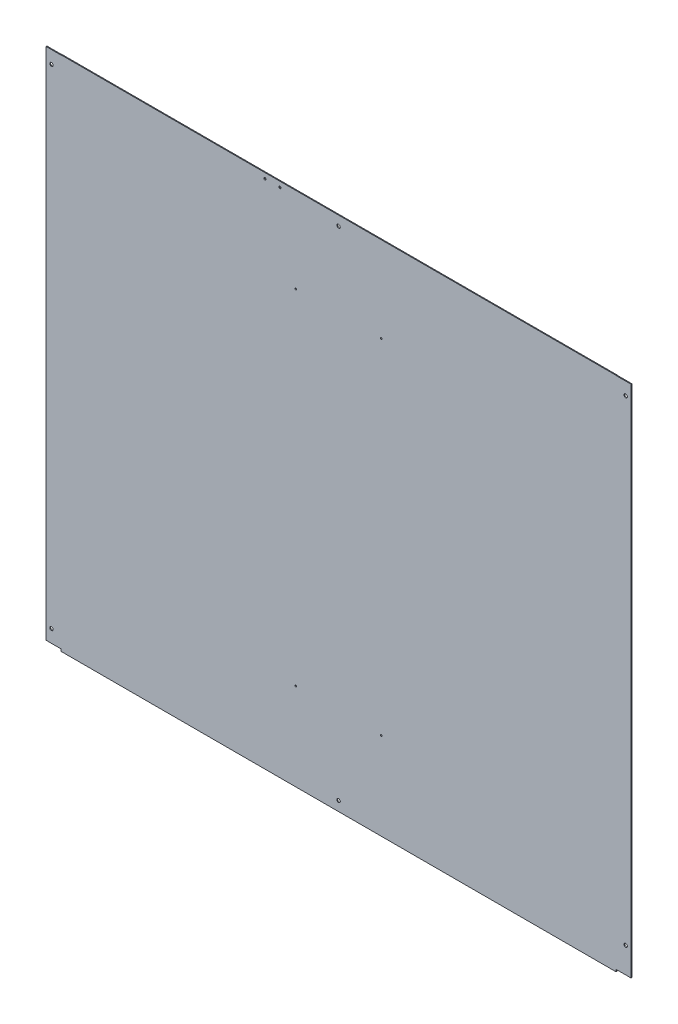
ISO-10303-21;
HEADER;
FILE_DESCRIPTION(('STEP AP214'),'2;1');
FILE_NAME('part.step','',(''),(''),'','','');
FILE_SCHEMA(('AUTOMOTIVE_DESIGN { 1 0 10303 214 1 1 1 1 }'));
ENDSEC;
DATA;
#1=APPLICATION_CONTEXT('core data for automotive mechanical design processes');
#2=APPLICATION_PROTOCOL_DEFINITION('international standard','automotive_design',2000,#1);
#3=PRODUCT_CONTEXT('',#1,'mechanical');
#4=PRODUCT('Part','Part','',(#3));
#5=PRODUCT_RELATED_PRODUCT_CATEGORY('part','',(#4));
#6=PRODUCT_DEFINITION_FORMATION('','',#4);
#7=PRODUCT_DEFINITION_CONTEXT('part definition',#1,'design');
#8=PRODUCT_DEFINITION('design','',#6,#7);
#9=PRODUCT_DEFINITION_SHAPE('','',#8);
#10=(LENGTH_UNIT() NAMED_UNIT(*) SI_UNIT(.MILLI.,.METRE.));
#11=(NAMED_UNIT(*) PLANE_ANGLE_UNIT() SI_UNIT($,.RADIAN.));
#12=(NAMED_UNIT(*) SI_UNIT($,.STERADIAN.) SOLID_ANGLE_UNIT());
#13=UNCERTAINTY_MEASURE_WITH_UNIT(LENGTH_MEASURE(1.E-05),#10,'distance_accuracy_value','');
#14=(GEOMETRIC_REPRESENTATION_CONTEXT(3) GLOBAL_UNCERTAINTY_ASSIGNED_CONTEXT((#13)) GLOBAL_UNIT_ASSIGNED_CONTEXT((#10,
#11,#12)) REPRESENTATION_CONTEXT('',''));
#15=CARTESIAN_POINT('',(0.,0.,0.));
#16=DIRECTION('',(0.,0.,1.));
#17=DIRECTION('',(1.,0.,0.));
#18=AXIS2_PLACEMENT_3D('',#15,#16,#17);
#19=CARTESIAN_POINT('',(1335.,0.,-2.));
#20=DIRECTION('',(1.,0.,0.));
#21=DIRECTION('',(0.,1.,0.));
#22=AXIS2_PLACEMENT_3D('',#19,#20,#21);
#23=PLANE('',#22);
#24=DIRECTION('',(0.,1.,0.));
#25=VECTOR('',#24,1.);
#26=CARTESIAN_POINT('',(1335.,0.,0.));
#27=LINE('',#26,#25);
#28=CARTESIAN_POINT('',(1335.,0.,0.));
#29=VERTEX_POINT('',#28);
#30=CARTESIAN_POINT('',(1335.,5.,0.));
#31=VERTEX_POINT('',#30);
#32=EDGE_CURVE('E155',#29,#31,#27,.T.);
#33=ORIENTED_EDGE('',*,*,#32,.F.);
#34=DIRECTION('',(0.,0.,1.));
#35=VECTOR('',#34,1.);
#36=CARTESIAN_POINT('',(1335.,0.,-2.));
#37=LINE('',#36,#35);
#38=CARTESIAN_POINT('',(1335.,0.,-2.));
#39=VERTEX_POINT('',#38);
#40=EDGE_CURVE('E11',#39,#29,#37,.T.);
#41=ORIENTED_EDGE('',*,*,#40,.F.);
#42=DIRECTION('',(0.,1.,0.));
#43=VECTOR('',#42,1.);
#44=CARTESIAN_POINT('',(1335.,0.,-2.));
#45=LINE('',#44,#43);
#46=CARTESIAN_POINT('',(1335.,5.,-2.));
#47=VERTEX_POINT('',#46);
#48=EDGE_CURVE('E188',#39,#47,#45,.T.);
#49=ORIENTED_EDGE('',*,*,#48,.T.);
#50=DIRECTION('',(0.,0.,1.));
#51=VECTOR('',#50,1.);
#52=CARTESIAN_POINT('',(1335.,5.,-2.));
#53=LINE('',#52,#51);
#54=EDGE_CURVE('E37',#47,#31,#53,.T.);
#55=ORIENTED_EDGE('',*,*,#54,.T.);
#56=EDGE_LOOP('',(#33,#41,#49,#55));
#57=FACE_BOUND('',#56,.T.);
#58=ADVANCED_FACE('F34',(#57),#23,.T.);
#59=CARTESIAN_POINT('',(35.,0.,-2.));
#60=DIRECTION('',(0.,-1.,0.));
#61=DIRECTION('',(0.,0.,-1.));
#62=AXIS2_PLACEMENT_3D('',#59,#60,#61);
#63=PLANE('',#62);
#64=DIRECTION('',(1.,0.,0.));
#65=VECTOR('',#64,1.);
#66=CARTESIAN_POINT('',(35.,0.,0.));
#67=LINE('',#66,#65);
#68=CARTESIAN_POINT('',(35.,0.,0.));
#69=VERTEX_POINT('',#68);
#70=EDGE_CURVE('E186',#69,#29,#67,.T.);
#71=ORIENTED_EDGE('',*,*,#70,.F.);
#72=DIRECTION('',(0.,0.,1.));
#73=VECTOR('',#72,1.);
#74=CARTESIAN_POINT('',(35.,0.,-2.));
#75=LINE('',#74,#73);
#76=CARTESIAN_POINT('',(35.,0.,-2.));
#77=VERTEX_POINT('',#76);
#78=EDGE_CURVE('E43',#77,#69,#75,.T.);
#79=ORIENTED_EDGE('',*,*,#78,.F.);
#80=DIRECTION('',(1.,0.,0.));
#81=VECTOR('',#80,1.);
#82=CARTESIAN_POINT('',(35.,0.,-2.));
#83=LINE('',#82,#81);
#84=EDGE_CURVE('E145',#77,#39,#83,.T.);
#85=ORIENTED_EDGE('',*,*,#84,.T.);
#86=ORIENTED_EDGE('',*,*,#40,.T.);
#87=EDGE_LOOP('',(#71,#79,#85,#86));
#88=FACE_BOUND('',#87,.T.);
#89=ADVANCED_FACE('F208',(#88),#63,.T.);
#90=CARTESIAN_POINT('',(35.,0.,-2.));
#91=DIRECTION('',(-1.,0.,0.));
#92=DIRECTION('',(0.,0.,1.));
#93=AXIS2_PLACEMENT_3D('',#90,#91,#92);
#94=PLANE('',#93);
#95=DIRECTION('',(0.,-1.,0.));
#96=VECTOR('',#95,1.);
#97=CARTESIAN_POINT('',(35.,0.,0.));
#98=LINE('',#97,#96);
#99=CARTESIAN_POINT('',(35.,5.,0.));
#100=VERTEX_POINT('',#99);
#101=EDGE_CURVE('E132',#100,#69,#98,.T.);
#102=ORIENTED_EDGE('',*,*,#101,.F.);
#103=DIRECTION('',(0.,0.,1.));
#104=VECTOR('',#103,1.);
#105=CARTESIAN_POINT('',(35.,5.,-2.));
#106=LINE('',#105,#104);
#107=CARTESIAN_POINT('',(35.,5.,-2.));
#108=VERTEX_POINT('',#107);
#109=EDGE_CURVE('E127',#108,#100,#106,.T.);
#110=ORIENTED_EDGE('',*,*,#109,.F.);
#111=DIRECTION('',(0.,-1.,0.));
#112=VECTOR('',#111,1.);
#113=CARTESIAN_POINT('',(35.,0.,-2.));
#114=LINE('',#113,#112);
#115=EDGE_CURVE('E130',#108,#77,#114,.T.);
#116=ORIENTED_EDGE('',*,*,#115,.T.);
#117=ORIENTED_EDGE('',*,*,#78,.T.);
#118=EDGE_LOOP('',(#102,#110,#116,#117));
#119=FACE_BOUND('',#118,.T.);
#120=ADVANCED_FACE('F129',(#119),#94,.T.);
#121=CARTESIAN_POINT('',(35.,5.,-2.));
#122=DIRECTION('',(0.,-1.,0.));
#123=DIRECTION('',(1.,0.,0.));
#124=AXIS2_PLACEMENT_3D('',#121,#122,#123);
#125=PLANE('',#124);
#126=DIRECTION('',(1.,0.,0.));
#127=VECTOR('',#126,1.);
#128=CARTESIAN_POINT('',(35.,5.,0.));
#129=LINE('',#128,#127);
#130=CARTESIAN_POINT('',(1.52655665885959E-13,5.,0.));
#131=VERTEX_POINT('',#130);
#132=EDGE_CURVE('E183',#131,#100,#129,.T.);
#133=ORIENTED_EDGE('',*,*,#132,.F.);
#134=DIRECTION('',(0.,0.,1.));
#135=VECTOR('',#134,1.);
#136=CARTESIAN_POINT('',(1.52655665885959E-13,5.,-2.));
#137=LINE('',#136,#135);
#138=CARTESIAN_POINT('',(1.52655665885959E-13,5.,-2.));
#139=VERTEX_POINT('',#138);
#140=EDGE_CURVE('E137',#139,#131,#137,.T.);
#141=ORIENTED_EDGE('',*,*,#140,.F.);
#142=DIRECTION('',(1.,0.,0.));
#143=VECTOR('',#142,1.);
#144=CARTESIAN_POINT('',(35.,5.,-2.));
#145=LINE('',#144,#143);
#146=EDGE_CURVE('E143',#139,#108,#145,.T.);
#147=ORIENTED_EDGE('',*,*,#146,.T.);
#148=ORIENTED_EDGE('',*,*,#109,.T.);
#149=EDGE_LOOP('',(#133,#141,#147,#148));
#150=FACE_BOUND('',#149,.T.);
#151=ADVANCED_FACE('F147',(#150),#125,.T.);
#152=CARTESIAN_POINT('',(0.,1209.5,-2.));
#153=DIRECTION('',(-1.,0.,0.));
#154=DIRECTION('',(0.,-1.,0.));
#155=AXIS2_PLACEMENT_3D('',#152,#153,#154);
#156=PLANE('',#155);
#157=DIRECTION('',(0.,-1.,0.));
#158=VECTOR('',#157,1.);
#159=CARTESIAN_POINT('',(0.,1209.5,0.));
#160=LINE('',#159,#158);
#161=CARTESIAN_POINT('',(0.,1209.5,0.));
#162=VERTEX_POINT('',#161);
#163=EDGE_CURVE('E180',#162,#131,#160,.T.);
#164=ORIENTED_EDGE('',*,*,#163,.F.);
#165=DIRECTION('',(0.,0.,1.));
#166=VECTOR('',#165,1.);
#167=CARTESIAN_POINT('',(0.,1209.5,-2.));
#168=LINE('',#167,#166);
#169=CARTESIAN_POINT('',(0.,1209.5,-2.));
#170=VERTEX_POINT('',#169);
#171=EDGE_CURVE('E192',#170,#162,#168,.T.);
#172=ORIENTED_EDGE('',*,*,#171,.F.);
#173=DIRECTION('',(0.,-1.,0.));
#174=VECTOR('',#173,1.);
#175=CARTESIAN_POINT('',(0.,1209.5,-2.));
#176=LINE('',#175,#174);
#177=EDGE_CURVE('E148',#170,#139,#176,.T.);
#178=ORIENTED_EDGE('',*,*,#177,.T.);
#179=ORIENTED_EDGE('',*,*,#140,.T.);
#180=EDGE_LOOP('',(#164,#172,#178,#179));
#181=FACE_BOUND('',#180,.T.);
#182=ADVANCED_FACE('F221',(#181),#156,.T.);
#183=CARTESIAN_POINT('',(35.,1209.5,-2.));
#184=DIRECTION('',(0.,1.,0.));
#185=DIRECTION('',(-1.,0.,0.));
#186=AXIS2_PLACEMENT_3D('',#183,#184,#185);
#187=PLANE('',#186);
#188=DIRECTION('',(-1.,0.,0.));
#189=VECTOR('',#188,1.);
#190=CARTESIAN_POINT('',(35.,1209.5,0.));
#191=LINE('',#190,#189);
#192=CARTESIAN_POINT('',(35.,1209.5,0.));
#193=VERTEX_POINT('',#192);
#194=EDGE_CURVE('E177',#193,#162,#191,.T.);
#195=ORIENTED_EDGE('',*,*,#194,.F.);
#196=DIRECTION('',(0.,0.,1.));
#197=VECTOR('',#196,1.);
#198=CARTESIAN_POINT('',(35.,1209.5,-2.));
#199=LINE('',#198,#197);
#200=CARTESIAN_POINT('',(35.,1209.5,-2.));
#201=VERTEX_POINT('',#200);
#202=EDGE_CURVE('E194',#201,#193,#199,.T.);
#203=ORIENTED_EDGE('',*,*,#202,.F.);
#204=DIRECTION('',(-1.,0.,0.));
#205=VECTOR('',#204,1.);
#206=CARTESIAN_POINT('',(35.,1209.5,-2.));
#207=LINE('',#206,#205);
#208=EDGE_CURVE('E150',#201,#170,#207,.T.);
#209=ORIENTED_EDGE('',*,*,#208,.T.);
#210=ORIENTED_EDGE('',*,*,#171,.T.);
#211=EDGE_LOOP('',(#195,#203,#209,#210));
#212=FACE_BOUND('',#211,.T.);
#213=ADVANCED_FACE('F224',(#212),#187,.T.);
#214=CARTESIAN_POINT('',(35.,1210.,-2.));
#215=DIRECTION('',(-1.,0.,0.));
#216=DIRECTION('',(0.,0.,1.));
#217=AXIS2_PLACEMENT_3D('',#214,#215,#216);
#218=PLANE('',#217);
#219=DIRECTION('',(0.,-1.,0.));
#220=VECTOR('',#219,1.);
#221=CARTESIAN_POINT('',(35.,1210.,0.));
#222=LINE('',#221,#220);
#223=CARTESIAN_POINT('',(35.,1210.,0.));
#224=VERTEX_POINT('',#223);
#225=EDGE_CURVE('E174',#224,#193,#222,.T.);
#226=ORIENTED_EDGE('',*,*,#225,.F.);
#227=DIRECTION('',(0.,0.,1.));
#228=VECTOR('',#227,1.);
#229=CARTESIAN_POINT('',(35.,1210.,-2.));
#230=LINE('',#229,#228);
#231=CARTESIAN_POINT('',(35.,1210.,-2.));
#232=VERTEX_POINT('',#231);
#233=EDGE_CURVE('E196',#232,#224,#230,.T.);
#234=ORIENTED_EDGE('',*,*,#233,.F.);
#235=DIRECTION('',(0.,-1.,0.));
#236=VECTOR('',#235,1.);
#237=CARTESIAN_POINT('',(35.,1210.,-2.));
#238=LINE('',#237,#236);
#239=EDGE_CURVE('E398',#232,#201,#238,.T.);
#240=ORIENTED_EDGE('',*,*,#239,.T.);
#241=ORIENTED_EDGE('',*,*,#202,.T.);
#242=EDGE_LOOP('',(#226,#234,#240,#241));
#243=FACE_BOUND('',#242,.T.);
#244=ADVANCED_FACE('F228',(#243),#218,.T.);
#245=CARTESIAN_POINT('',(1335.,1210.,-2.));
#246=DIRECTION('',(0.,1.,0.));
#247=DIRECTION('',(0.,0.,1.));
#248=AXIS2_PLACEMENT_3D('',#245,#246,#247);
#249=PLANE('',#248);
#250=DIRECTION('',(-1.,0.,0.));
#251=VECTOR('',#250,1.);
#252=CARTESIAN_POINT('',(1335.,1210.,0.));
#253=LINE('',#252,#251);
#254=CARTESIAN_POINT('',(1335.,1210.,0.));
#255=VERTEX_POINT('',#254);
#256=EDGE_CURVE('E171',#255,#224,#253,.T.);
#257=ORIENTED_EDGE('',*,*,#256,.F.);
#258=DIRECTION('',(0.,0.,1.));
#259=VECTOR('',#258,1.);
#260=CARTESIAN_POINT('',(1335.,1210.,-2.));
#261=LINE('',#260,#259);
#262=CARTESIAN_POINT('',(1335.,1210.,-2.));
#263=VERTEX_POINT('',#262);
#264=EDGE_CURVE('E198',#263,#255,#261,.T.);
#265=ORIENTED_EDGE('',*,*,#264,.F.);
#266=DIRECTION('',(-1.,0.,0.));
#267=VECTOR('',#266,1.);
#268=CARTESIAN_POINT('',(1335.,1210.,-2.));
#269=LINE('',#268,#267);
#270=EDGE_CURVE('E395',#263,#232,#269,.T.);
#271=ORIENTED_EDGE('',*,*,#270,.T.);
#272=ORIENTED_EDGE('',*,*,#233,.T.);
#273=EDGE_LOOP('',(#257,#265,#271,#272));
#274=FACE_BOUND('',#273,.T.);
#275=ADVANCED_FACE('F232',(#274),#249,.T.);
#276=CARTESIAN_POINT('',(1335.,1210.,-2.));
#277=DIRECTION('',(1.,0.,0.));
#278=DIRECTION('',(0.,0.,-1.));
#279=AXIS2_PLACEMENT_3D('',#276,#277,#278);
#280=PLANE('',#279);
#281=DIRECTION('',(0.,1.,0.));
#282=VECTOR('',#281,1.);
#283=CARTESIAN_POINT('',(1335.,1210.,0.));
#284=LINE('',#283,#282);
#285=CARTESIAN_POINT('',(1335.,1209.5,0.));
#286=VERTEX_POINT('',#285);
#287=EDGE_CURVE('E168',#286,#255,#284,.T.);
#288=ORIENTED_EDGE('',*,*,#287,.F.);
#289=DIRECTION('',(0.,0.,1.));
#290=VECTOR('',#289,1.);
#291=CARTESIAN_POINT('',(1335.,1209.5,-2.));
#292=LINE('',#291,#290);
#293=CARTESIAN_POINT('',(1335.,1209.5,-2.));
#294=VERTEX_POINT('',#293);
#295=EDGE_CURVE('E200',#294,#286,#292,.T.);
#296=ORIENTED_EDGE('',*,*,#295,.F.);
#297=DIRECTION('',(0.,1.,0.));
#298=VECTOR('',#297,1.);
#299=CARTESIAN_POINT('',(1335.,1210.,-2.));
#300=LINE('',#299,#298);
#301=EDGE_CURVE('E392',#294,#263,#300,.T.);
#302=ORIENTED_EDGE('',*,*,#301,.T.);
#303=ORIENTED_EDGE('',*,*,#264,.T.);
#304=EDGE_LOOP('',(#288,#296,#302,#303));
#305=FACE_BOUND('',#304,.T.);
#306=ADVANCED_FACE('F236',(#305),#280,.T.);
#307=CARTESIAN_POINT('',(1335.,1209.5,-2.));
#308=DIRECTION('',(0.,1.,0.));
#309=DIRECTION('',(-1.,0.,0.));
#310=AXIS2_PLACEMENT_3D('',#307,#308,#309);
#311=PLANE('',#310);
#312=DIRECTION('',(-1.,0.,0.));
#313=VECTOR('',#312,1.);
#314=CARTESIAN_POINT('',(1335.,1209.5,0.));
#315=LINE('',#314,#313);
#316=CARTESIAN_POINT('',(1370.,1209.5,0.));
#317=VERTEX_POINT('',#316);
#318=EDGE_CURVE('E165',#317,#286,#315,.T.);
#319=ORIENTED_EDGE('',*,*,#318,.F.);
#320=DIRECTION('',(0.,0.,1.));
#321=VECTOR('',#320,1.);
#322=CARTESIAN_POINT('',(1370.,1209.5,-2.));
#323=LINE('',#322,#321);
#324=CARTESIAN_POINT('',(1370.,1209.5,-2.));
#325=VERTEX_POINT('',#324);
#326=EDGE_CURVE('E202',#325,#317,#323,.T.);
#327=ORIENTED_EDGE('',*,*,#326,.F.);
#328=DIRECTION('',(-1.,0.,0.));
#329=VECTOR('',#328,1.);
#330=CARTESIAN_POINT('',(1335.,1209.5,-2.));
#331=LINE('',#330,#329);
#332=EDGE_CURVE('E389',#325,#294,#331,.T.);
#333=ORIENTED_EDGE('',*,*,#332,.T.);
#334=ORIENTED_EDGE('',*,*,#295,.T.);
#335=EDGE_LOOP('',(#319,#327,#333,#334));
#336=FACE_BOUND('',#335,.T.);
#337=ADVANCED_FACE('F240',(#336),#311,.T.);
#338=CARTESIAN_POINT('',(1370.,5.,-2.));
#339=DIRECTION('',(1.,0.,0.));
#340=DIRECTION('',(0.,1.,0.));
#341=AXIS2_PLACEMENT_3D('',#338,#339,#340);
#342=PLANE('',#341);
#343=DIRECTION('',(0.,1.,0.));
#344=VECTOR('',#343,1.);
#345=CARTESIAN_POINT('',(1370.,5.,0.));
#346=LINE('',#345,#344);
#347=CARTESIAN_POINT('',(1370.,5.,0.));
#348=VERTEX_POINT('',#347);
#349=EDGE_CURVE('E162',#348,#317,#346,.T.);
#350=ORIENTED_EDGE('',*,*,#349,.F.);
#351=DIRECTION('',(0.,0.,1.));
#352=VECTOR('',#351,1.);
#353=CARTESIAN_POINT('',(1370.,5.,-2.));
#354=LINE('',#353,#352);
#355=CARTESIAN_POINT('',(1370.,5.,-2.));
#356=VERTEX_POINT('',#355);
#357=EDGE_CURVE('E203',#356,#348,#354,.T.);
#358=ORIENTED_EDGE('',*,*,#357,.F.);
#359=DIRECTION('',(0.,1.,0.));
#360=VECTOR('',#359,1.);
#361=CARTESIAN_POINT('',(1370.,5.,-2.));
#362=LINE('',#361,#360);
#363=EDGE_CURVE('E386',#356,#325,#362,.T.);
#364=ORIENTED_EDGE('',*,*,#363,.T.);
#365=ORIENTED_EDGE('',*,*,#326,.T.);
#366=EDGE_LOOP('',(#350,#358,#364,#365));
#367=FACE_BOUND('',#366,.T.);
#368=ADVANCED_FACE('F244',(#367),#342,.T.);
#369=CARTESIAN_POINT('',(1335.,5.,-2.));
#370=DIRECTION('',(0.,-1.,0.));
#371=DIRECTION('',(1.,0.,0.));
#372=AXIS2_PLACEMENT_3D('',#369,#370,#371);
#373=PLANE('',#372);
#374=DIRECTION('',(1.,0.,0.));
#375=VECTOR('',#374,1.);
#376=CARTESIAN_POINT('',(1335.,5.,0.));
#377=LINE('',#376,#375);
#378=EDGE_CURVE('E158',#31,#348,#377,.T.);
#379=ORIENTED_EDGE('',*,*,#378,.F.);
#380=ORIENTED_EDGE('',*,*,#54,.F.);
#381=DIRECTION('',(1.,0.,0.));
#382=VECTOR('',#381,1.);
#383=CARTESIAN_POINT('',(1335.,5.,-2.));
#384=LINE('',#383,#382);
#385=EDGE_CURVE('E384',#47,#356,#384,.T.);
#386=ORIENTED_EDGE('',*,*,#385,.T.);
#387=ORIENTED_EDGE('',*,*,#357,.T.);
#388=EDGE_LOOP('',(#379,#380,#386,#387));
#389=FACE_BOUND('',#388,.T.);
#390=ADVANCED_FACE('F205',(#389),#373,.T.);
#391=CARTESIAN_POINT('',(1335.,5.,-2.));
#392=DIRECTION('',(0.,0.,-1.));
#393=DIRECTION('',(-1.,0.,0.));
#394=AXIS2_PLACEMENT_3D('',#391,#392,#393);
#395=PLANE('',#394);
#396=CARTESIAN_POINT('',(785.,204.5,-2.));
#397=DIRECTION('',(0.,0.,-1.));
#398=DIRECTION('',(1.,0.,0.));
#399=AXIS2_PLACEMENT_3D('',#396,#397,#398);
#400=CIRCLE('',#399,2.);
#401=CARTESIAN_POINT('',(787.,204.5,-2.));
#402=VERTEX_POINT('',#401);
#403=EDGE_CURVE('E311',#402,#402,#400,.T.);
#404=ORIENTED_EDGE('',*,*,#403,.F.);
#405=EDGE_LOOP('',(#404));
#406=FACE_BOUND('',#405,.T.);
#407=CARTESIAN_POINT('',(585.,204.5,-2.));
#408=DIRECTION('',(0.,0.,-1.));
#409=DIRECTION('',(1.,0.,0.));
#410=AXIS2_PLACEMENT_3D('',#407,#408,#409);
#411=CIRCLE('',#410,2.);
#412=CARTESIAN_POINT('',(587.,204.5,-2.));
#413=VERTEX_POINT('',#412);
#414=EDGE_CURVE('E315',#413,#413,#411,.T.);
#415=ORIENTED_EDGE('',*,*,#414,.F.);
#416=EDGE_LOOP('',(#415));
#417=FACE_BOUND('',#416,.T.);
#418=CARTESIAN_POINT('',(585.,1010.,-2.));
#419=DIRECTION('',(0.,0.,-1.));
#420=DIRECTION('',(-1.,0.,0.));
#421=AXIS2_PLACEMENT_3D('',#418,#419,#420);
#422=CIRCLE('',#421,2.);
#423=CARTESIAN_POINT('',(583.,1010.,-2.));
#424=VERTEX_POINT('',#423);
#425=EDGE_CURVE('E324',#424,#424,#422,.T.);
#426=ORIENTED_EDGE('',*,*,#425,.F.);
#427=EDGE_LOOP('',(#426));
#428=FACE_BOUND('',#427,.T.);
#429=CARTESIAN_POINT('',(785.,1010.,-2.));
#430=DIRECTION('',(0.,0.,-1.));
#431=DIRECTION('',(-1.,0.,0.));
#432=AXIS2_PLACEMENT_3D('',#429,#430,#431);
#433=CIRCLE('',#432,2.);
#434=CARTESIAN_POINT('',(783.,1010.,-2.));
#435=VERTEX_POINT('',#434);
#436=EDGE_CURVE('E330',#435,#435,#433,.T.);
#437=ORIENTED_EDGE('',*,*,#436,.F.);
#438=EDGE_LOOP('',(#437));
#439=FACE_BOUND('',#438,.T.);
#440=CARTESIAN_POINT('',(547.539678476468,1197.5,-2.));
#441=DIRECTION('',(0.,0.,-1.));
#442=DIRECTION('',(-1.,0.,0.));
#443=AXIS2_PLACEMENT_3D('',#440,#441,#442);
#444=CIRCLE('',#443,2.64999999999999);
#445=CARTESIAN_POINT('',(544.889678476468,1197.5,-2.));
#446=VERTEX_POINT('',#445);
#447=EDGE_CURVE('E336',#446,#446,#444,.F.);
#448=ORIENTED_EDGE('',*,*,#447,.T.);
#449=EDGE_LOOP('',(#448));
#450=FACE_BOUND('',#449,.T.);
#451=CARTESIAN_POINT('',(512.539678476468,1197.5,-2.));
#452=DIRECTION('',(0.,0.,-1.));
#453=DIRECTION('',(-1.,0.,0.));
#454=AXIS2_PLACEMENT_3D('',#451,#452,#453);
#455=CIRCLE('',#454,2.64999999999999);
#456=CARTESIAN_POINT('',(509.889678476468,1197.5,-2.));
#457=VERTEX_POINT('',#456);
#458=EDGE_CURVE('E340',#457,#457,#455,.F.);
#459=ORIENTED_EDGE('',*,*,#458,.T.);
#460=EDGE_LOOP('',(#459));
#461=FACE_BOUND('',#460,.T.);
#462=CARTESIAN_POINT('',(685.,1187.5,-2.));
#463=DIRECTION('',(0.,0.,-1.));
#464=DIRECTION('',(-1.,0.,0.));
#465=AXIS2_PLACEMENT_3D('',#462,#463,#464);
#466=CIRCLE('',#465,3.99999999999999);
#467=CARTESIAN_POINT('',(681.,1187.5,-2.));
#468=VERTEX_POINT('',#467);
#469=EDGE_CURVE('E346',#468,#468,#466,.T.);
#470=ORIENTED_EDGE('',*,*,#469,.F.);
#471=EDGE_LOOP('',(#470));
#472=FACE_BOUND('',#471,.T.);
#473=CARTESIAN_POINT('',(685.,22.4999999999999,-2.));
#474=DIRECTION('',(0.,0.,-1.));
#475=DIRECTION('',(-1.,0.,0.));
#476=AXIS2_PLACEMENT_3D('',#473,#474,#475);
#477=CIRCLE('',#476,3.99999999999999);
#478=CARTESIAN_POINT('',(681.,22.4999999999999,-2.));
#479=VERTEX_POINT('',#478);
#480=EDGE_CURVE('E354',#479,#479,#477,.T.);
#481=ORIENTED_EDGE('',*,*,#480,.F.);
#482=EDGE_LOOP('',(#481));
#483=FACE_BOUND('',#482,.T.);
#484=CARTESIAN_POINT('',(1357.5,1179.5,-2.));
#485=DIRECTION('',(0.,0.,-1.));
#486=DIRECTION('',(-1.,0.,0.));
#487=AXIS2_PLACEMENT_3D('',#484,#485,#486);
#488=CIRCLE('',#487,3.99999999999999);
#489=CARTESIAN_POINT('',(1353.5,1179.5,-2.));
#490=VERTEX_POINT('',#489);
#491=EDGE_CURVE('E360',#490,#490,#488,.T.);
#492=ORIENTED_EDGE('',*,*,#491,.F.);
#493=EDGE_LOOP('',(#492));
#494=FACE_BOUND('',#493,.T.);
#495=CARTESIAN_POINT('',(1357.5,65.,-2.));
#496=DIRECTION('',(0.,0.,-1.));
#497=DIRECTION('',(-1.,0.,0.));
#498=AXIS2_PLACEMENT_3D('',#495,#496,#497);
#499=CIRCLE('',#498,3.99999999999999);
#500=CARTESIAN_POINT('',(1353.5,65.,-2.));
#501=VERTEX_POINT('',#500);
#502=EDGE_CURVE('E366',#501,#501,#499,.T.);
#503=ORIENTED_EDGE('',*,*,#502,.F.);
#504=EDGE_LOOP('',(#503));
#505=FACE_BOUND('',#504,.T.);
#506=CARTESIAN_POINT('',(12.5,35.,-2.));
#507=DIRECTION('',(0.,0.,-1.));
#508=DIRECTION('',(-1.,0.,0.));
#509=AXIS2_PLACEMENT_3D('',#506,#507,#508);
#510=CIRCLE('',#509,4.);
#511=CARTESIAN_POINT('',(8.5,35.,-2.));
#512=VERTEX_POINT('',#511);
#513=EDGE_CURVE('E372',#512,#512,#510,.T.);
#514=ORIENTED_EDGE('',*,*,#513,.F.);
#515=EDGE_LOOP('',(#514));
#516=FACE_BOUND('',#515,.T.);
#517=CARTESIAN_POINT('',(12.5,1179.5,-2.));
#518=DIRECTION('',(0.,0.,-1.));
#519=DIRECTION('',(-1.,0.,0.));
#520=AXIS2_PLACEMENT_3D('',#517,#518,#519);
#521=CIRCLE('',#520,4.);
#522=CARTESIAN_POINT('',(8.50000000000001,1179.5,-2.));
#523=VERTEX_POINT('',#522);
#524=EDGE_CURVE('E378',#523,#523,#521,.T.);
#525=ORIENTED_EDGE('',*,*,#524,.F.);
#526=EDGE_LOOP('',(#525));
#527=FACE_BOUND('',#526,.T.);
#528=ORIENTED_EDGE('',*,*,#48,.F.);
#529=ORIENTED_EDGE('',*,*,#84,.F.);
#530=ORIENTED_EDGE('',*,*,#115,.F.);
#531=ORIENTED_EDGE('',*,*,#146,.F.);
#532=ORIENTED_EDGE('',*,*,#177,.F.);
#533=ORIENTED_EDGE('',*,*,#208,.F.);
#534=ORIENTED_EDGE('',*,*,#239,.F.);
#535=ORIENTED_EDGE('',*,*,#270,.F.);
#536=ORIENTED_EDGE('',*,*,#301,.F.);
#537=ORIENTED_EDGE('',*,*,#332,.F.);
#538=ORIENTED_EDGE('',*,*,#363,.F.);
#539=ORIENTED_EDGE('',*,*,#385,.F.);
#540=EDGE_LOOP('',(#528,#529,#530,#531,#532,#533,#534,#535,#536,#537,#538,#539));
#541=FACE_BOUND('',#540,.T.);
#542=ADVANCED_FACE('F141',(#406,#417,#428,#439,#450,#461,#472,#483,#494,#505,#516,#527,#541),
#395,.T.);
#543=CARTESIAN_POINT('',(1335.,5.,0.));
#544=DIRECTION('',(0.,0.,-1.));
#545=DIRECTION('',(-1.,0.,0.));
#546=AXIS2_PLACEMENT_3D('',#543,#544,#545);
#547=PLANE('',#546);
#548=CARTESIAN_POINT('',(785.,204.5,0.));
#549=DIRECTION('',(0.,0.,-1.));
#550=DIRECTION('',(-1.,0.,0.));
#551=AXIS2_PLACEMENT_3D('',#548,#549,#550);
#552=CIRCLE('',#551,2.);
#553=CARTESIAN_POINT('',(783.,204.5,0.));
#554=VERTEX_POINT('',#553);
#555=EDGE_CURVE('E314',#554,#554,#552,.F.);
#556=ORIENTED_EDGE('',*,*,#555,.F.);
#557=EDGE_LOOP('',(#556));
#558=FACE_BOUND('',#557,.T.);
#559=CARTESIAN_POINT('',(585.,204.5,0.));
#560=DIRECTION('',(0.,0.,-1.));
#561=DIRECTION('',(-1.,0.,0.));
#562=AXIS2_PLACEMENT_3D('',#559,#560,#561);
#563=CIRCLE('',#562,2.);
#564=CARTESIAN_POINT('',(583.,204.5,0.));
#565=VERTEX_POINT('',#564);
#566=EDGE_CURVE('E318',#565,#565,#563,.F.);
#567=ORIENTED_EDGE('',*,*,#566,.F.);
#568=EDGE_LOOP('',(#567));
#569=FACE_BOUND('',#568,.T.);
#570=CARTESIAN_POINT('',(585.,1010.,0.));
#571=DIRECTION('',(0.,0.,-1.));
#572=DIRECTION('',(-1.,0.,0.));
#573=AXIS2_PLACEMENT_3D('',#570,#571,#572);
#574=CIRCLE('',#573,2.);
#575=CARTESIAN_POINT('',(583.,1010.,0.));
#576=VERTEX_POINT('',#575);
#577=EDGE_CURVE('E327',#576,#576,#574,.F.);
#578=ORIENTED_EDGE('',*,*,#577,.F.);
#579=EDGE_LOOP('',(#578));
#580=FACE_BOUND('',#579,.T.);
#581=CARTESIAN_POINT('',(785.,1010.,0.));
#582=DIRECTION('',(0.,0.,-1.));
#583=DIRECTION('',(-1.,0.,0.));
#584=AXIS2_PLACEMENT_3D('',#581,#582,#583);
#585=CIRCLE('',#584,2.);
#586=CARTESIAN_POINT('',(783.,1010.,0.));
#587=VERTEX_POINT('',#586);
#588=EDGE_CURVE('E333',#587,#587,#585,.F.);
#589=ORIENTED_EDGE('',*,*,#588,.F.);
#590=EDGE_LOOP('',(#589));
#591=FACE_BOUND('',#590,.T.);
#592=CARTESIAN_POINT('',(547.539678476468,1197.5,0.));
#593=DIRECTION('',(0.,0.,1.));
#594=DIRECTION('',(1.,0.,0.));
#595=AXIS2_PLACEMENT_3D('',#592,#593,#594);
#596=CIRCLE('',#595,2.64999999999999);
#597=CARTESIAN_POINT('',(550.189678476468,1197.5,0.));
#598=VERTEX_POINT('',#597);
#599=EDGE_CURVE('E337',#598,#598,#596,.T.);
#600=ORIENTED_EDGE('',*,*,#599,.F.);
#601=EDGE_LOOP('',(#600));
#602=FACE_BOUND('',#601,.T.);
#603=CARTESIAN_POINT('',(512.539678476468,1197.5,0.));
#604=DIRECTION('',(0.,0.,1.));
#605=DIRECTION('',(1.,0.,0.));
#606=AXIS2_PLACEMENT_3D('',#603,#604,#605);
#607=CIRCLE('',#606,2.64999999999999);
#608=CARTESIAN_POINT('',(515.189678476468,1197.5,0.));
#609=VERTEX_POINT('',#608);
#610=EDGE_CURVE('E343',#609,#609,#607,.T.);
#611=ORIENTED_EDGE('',*,*,#610,.F.);
#612=EDGE_LOOP('',(#611));
#613=FACE_BOUND('',#612,.T.);
#614=CARTESIAN_POINT('',(685.,1187.5,0.));
#615=DIRECTION('',(0.,0.,-1.));
#616=DIRECTION('',(-1.,0.,0.));
#617=AXIS2_PLACEMENT_3D('',#614,#615,#616);
#618=CIRCLE('',#617,3.99999999999999);
#619=CARTESIAN_POINT('',(681.,1187.5,0.));
#620=VERTEX_POINT('',#619);
#621=EDGE_CURVE('E351',#620,#620,#618,.F.);
#622=ORIENTED_EDGE('',*,*,#621,.F.);
#623=EDGE_LOOP('',(#622));
#624=FACE_BOUND('',#623,.T.);
#625=CARTESIAN_POINT('',(685.,22.4999999999999,0.));
#626=DIRECTION('',(0.,0.,-1.));
#627=DIRECTION('',(-1.,0.,0.));
#628=AXIS2_PLACEMENT_3D('',#625,#626,#627);
#629=CIRCLE('',#628,3.99999999999999);
#630=CARTESIAN_POINT('',(681.,22.4999999999999,0.));
#631=VERTEX_POINT('',#630);
#632=EDGE_CURVE('E357',#631,#631,#629,.F.);
#633=ORIENTED_EDGE('',*,*,#632,.F.);
#634=EDGE_LOOP('',(#633));
#635=FACE_BOUND('',#634,.T.);
#636=CARTESIAN_POINT('',(1357.5,1179.5,0.));
#637=DIRECTION('',(0.,0.,-1.));
#638=DIRECTION('',(-1.,0.,0.));
#639=AXIS2_PLACEMENT_3D('',#636,#637,#638);
#640=CIRCLE('',#639,3.99999999999999);
#641=CARTESIAN_POINT('',(1353.5,1179.5,0.));
#642=VERTEX_POINT('',#641);
#643=EDGE_CURVE('E363',#642,#642,#640,.F.);
#644=ORIENTED_EDGE('',*,*,#643,.F.);
#645=EDGE_LOOP('',(#644));
#646=FACE_BOUND('',#645,.T.);
#647=CARTESIAN_POINT('',(1357.5,65.,0.));
#648=DIRECTION('',(0.,0.,-1.));
#649=DIRECTION('',(-1.,0.,0.));
#650=AXIS2_PLACEMENT_3D('',#647,#648,#649);
#651=CIRCLE('',#650,3.99999999999999);
#652=CARTESIAN_POINT('',(1353.5,65.,0.));
#653=VERTEX_POINT('',#652);
#654=EDGE_CURVE('E369',#653,#653,#651,.F.);
#655=ORIENTED_EDGE('',*,*,#654,.F.);
#656=EDGE_LOOP('',(#655));
#657=FACE_BOUND('',#656,.T.);
#658=CARTESIAN_POINT('',(12.5,35.,0.));
#659=DIRECTION('',(0.,0.,-1.));
#660=DIRECTION('',(-1.,0.,0.));
#661=AXIS2_PLACEMENT_3D('',#658,#659,#660);
#662=CIRCLE('',#661,4.);
#663=CARTESIAN_POINT('',(8.5,35.,0.));
#664=VERTEX_POINT('',#663);
#665=EDGE_CURVE('E375',#664,#664,#662,.F.);
#666=ORIENTED_EDGE('',*,*,#665,.F.);
#667=EDGE_LOOP('',(#666));
#668=FACE_BOUND('',#667,.T.);
#669=CARTESIAN_POINT('',(12.5,1179.5,0.));
#670=DIRECTION('',(0.,0.,-1.));
#671=DIRECTION('',(-1.,0.,0.));
#672=AXIS2_PLACEMENT_3D('',#669,#670,#671);
#673=CIRCLE('',#672,4.);
#674=CARTESIAN_POINT('',(8.50000000000001,1179.5,0.));
#675=VERTEX_POINT('',#674);
#676=EDGE_CURVE('E159',#675,#675,#673,.F.);
#677=ORIENTED_EDGE('',*,*,#676,.F.);
#678=EDGE_LOOP('',(#677));
#679=FACE_BOUND('',#678,.T.);
#680=ORIENTED_EDGE('',*,*,#32,.T.);
#681=ORIENTED_EDGE('',*,*,#378,.T.);
#682=ORIENTED_EDGE('',*,*,#349,.T.);
#683=ORIENTED_EDGE('',*,*,#318,.T.);
#684=ORIENTED_EDGE('',*,*,#287,.T.);
#685=ORIENTED_EDGE('',*,*,#256,.T.);
#686=ORIENTED_EDGE('',*,*,#225,.T.);
#687=ORIENTED_EDGE('',*,*,#194,.T.);
#688=ORIENTED_EDGE('',*,*,#163,.T.);
#689=ORIENTED_EDGE('',*,*,#132,.T.);
#690=ORIENTED_EDGE('',*,*,#101,.T.);
#691=ORIENTED_EDGE('',*,*,#70,.T.);
#692=EDGE_LOOP('',(#680,#681,#682,#683,#684,#685,#686,#687,#688,#689,#690,#691));
#693=FACE_BOUND('',#692,.T.);
#694=ADVANCED_FACE('F207',(#558,#569,#580,#591,#602,#613,#624,#635,#646,#657,#668,#679,#693),
#547,.F.);
#695=CARTESIAN_POINT('',(12.5,1179.5,0.00100000000000013));
#696=DIRECTION('',(0.,0.,-1.));
#697=DIRECTION('',(-1.,0.,0.));
#698=AXIS2_PLACEMENT_3D('',#695,#696,#697);
#699=CYLINDRICAL_SURFACE('',#698,4.);
#700=ORIENTED_EDGE('',*,*,#524,.T.);
#701=EDGE_LOOP('',(#700));
#702=FACE_BOUND('',#701,.T.);
#703=ORIENTED_EDGE('',*,*,#676,.T.);
#704=EDGE_LOOP('',(#703));
#705=FACE_BOUND('',#704,.T.);
#706=ADVANCED_FACE('F256',(#702,#705),#699,.F.);
#707=CARTESIAN_POINT('',(12.5,35.,0.00100000000000013));
#708=DIRECTION('',(0.,0.,-1.));
#709=DIRECTION('',(-1.,0.,0.));
#710=AXIS2_PLACEMENT_3D('',#707,#708,#709);
#711=CYLINDRICAL_SURFACE('',#710,4.);
#712=ORIENTED_EDGE('',*,*,#513,.T.);
#713=EDGE_LOOP('',(#712));
#714=FACE_BOUND('',#713,.T.);
#715=ORIENTED_EDGE('',*,*,#665,.T.);
#716=EDGE_LOOP('',(#715));
#717=FACE_BOUND('',#716,.T.);
#718=ADVANCED_FACE('F263',(#714,#717),#711,.F.);
#719=CARTESIAN_POINT('',(1357.5,65.,0.00100000000000013));
#720=DIRECTION('',(0.,0.,-1.));
#721=DIRECTION('',(-1.,0.,0.));
#722=AXIS2_PLACEMENT_3D('',#719,#720,#721);
#723=CYLINDRICAL_SURFACE('',#722,3.99999999999999);
#724=ORIENTED_EDGE('',*,*,#502,.T.);
#725=EDGE_LOOP('',(#724));
#726=FACE_BOUND('',#725,.T.);
#727=ORIENTED_EDGE('',*,*,#654,.T.);
#728=EDGE_LOOP('',(#727));
#729=FACE_BOUND('',#728,.T.);
#730=ADVANCED_FACE('F267',(#726,#729),#723,.F.);
#731=CARTESIAN_POINT('',(1357.5,1179.5,0.00100000000000013));
#732=DIRECTION('',(0.,0.,-1.));
#733=DIRECTION('',(-1.,0.,0.));
#734=AXIS2_PLACEMENT_3D('',#731,#732,#733);
#735=CYLINDRICAL_SURFACE('',#734,3.99999999999999);
#736=ORIENTED_EDGE('',*,*,#491,.T.);
#737=EDGE_LOOP('',(#736));
#738=FACE_BOUND('',#737,.T.);
#739=ORIENTED_EDGE('',*,*,#643,.T.);
#740=EDGE_LOOP('',(#739));
#741=FACE_BOUND('',#740,.T.);
#742=ADVANCED_FACE('F271',(#738,#741),#735,.F.);
#743=CARTESIAN_POINT('',(685.,22.4999999999999,0.00100000000000013));
#744=DIRECTION('',(0.,0.,-1.));
#745=DIRECTION('',(-1.,0.,0.));
#746=AXIS2_PLACEMENT_3D('',#743,#744,#745);
#747=CYLINDRICAL_SURFACE('',#746,3.99999999999999);
#748=ORIENTED_EDGE('',*,*,#480,.T.);
#749=EDGE_LOOP('',(#748));
#750=FACE_BOUND('',#749,.T.);
#751=ORIENTED_EDGE('',*,*,#632,.T.);
#752=EDGE_LOOP('',(#751));
#753=FACE_BOUND('',#752,.T.);
#754=ADVANCED_FACE('F275',(#750,#753),#747,.F.);
#755=CARTESIAN_POINT('',(685.,1187.5,0.00100000000000013));
#756=DIRECTION('',(0.,0.,-1.));
#757=DIRECTION('',(-1.,0.,0.));
#758=AXIS2_PLACEMENT_3D('',#755,#756,#757);
#759=CYLINDRICAL_SURFACE('',#758,3.99999999999999);
#760=ORIENTED_EDGE('',*,*,#469,.T.);
#761=EDGE_LOOP('',(#760));
#762=FACE_BOUND('',#761,.T.);
#763=ORIENTED_EDGE('',*,*,#621,.T.);
#764=EDGE_LOOP('',(#763));
#765=FACE_BOUND('',#764,.T.);
#766=ADVANCED_FACE('F279',(#762,#765),#759,.F.);
#767=CARTESIAN_POINT('',(512.539678476468,1197.5,-2.001));
#768=DIRECTION('',(0.,0.,1.));
#769=DIRECTION('',(1.,0.,0.));
#770=AXIS2_PLACEMENT_3D('',#767,#768,#769);
#771=CYLINDRICAL_SURFACE('',#770,2.64999999999999);
#772=ORIENTED_EDGE('',*,*,#458,.F.);
#773=EDGE_LOOP('',(#772));
#774=FACE_BOUND('',#773,.T.);
#775=ORIENTED_EDGE('',*,*,#610,.T.);
#776=EDGE_LOOP('',(#775));
#777=FACE_BOUND('',#776,.T.);
#778=ADVANCED_FACE('F283',(#774,#777),#771,.F.);
#779=CARTESIAN_POINT('',(547.539678476468,1197.5,-2.001));
#780=DIRECTION('',(0.,0.,1.));
#781=DIRECTION('',(1.,0.,0.));
#782=AXIS2_PLACEMENT_3D('',#779,#780,#781);
#783=CYLINDRICAL_SURFACE('',#782,2.64999999999999);
#784=ORIENTED_EDGE('',*,*,#447,.F.);
#785=EDGE_LOOP('',(#784));
#786=FACE_BOUND('',#785,.T.);
#787=ORIENTED_EDGE('',*,*,#599,.T.);
#788=EDGE_LOOP('',(#787));
#789=FACE_BOUND('',#788,.T.);
#790=ADVANCED_FACE('F287',(#786,#789),#783,.F.);
#791=CARTESIAN_POINT('',(785.,1010.,0.00100000000000013));
#792=DIRECTION('',(0.,0.,-1.));
#793=DIRECTION('',(-1.,0.,0.));
#794=AXIS2_PLACEMENT_3D('',#791,#792,#793);
#795=CYLINDRICAL_SURFACE('',#794,2.);
#796=ORIENTED_EDGE('',*,*,#436,.T.);
#797=EDGE_LOOP('',(#796));
#798=FACE_BOUND('',#797,.T.);
#799=ORIENTED_EDGE('',*,*,#588,.T.);
#800=EDGE_LOOP('',(#799));
#801=FACE_BOUND('',#800,.T.);
#802=ADVANCED_FACE('F291',(#798,#801),#795,.F.);
#803=CARTESIAN_POINT('',(585.,1010.,0.00100000000000013));
#804=DIRECTION('',(0.,0.,-1.));
#805=DIRECTION('',(-1.,0.,0.));
#806=AXIS2_PLACEMENT_3D('',#803,#804,#805);
#807=CYLINDRICAL_SURFACE('',#806,2.);
#808=ORIENTED_EDGE('',*,*,#425,.T.);
#809=EDGE_LOOP('',(#808));
#810=FACE_BOUND('',#809,.T.);
#811=ORIENTED_EDGE('',*,*,#577,.T.);
#812=EDGE_LOOP('',(#811));
#813=FACE_BOUND('',#812,.T.);
#814=ADVANCED_FACE('F295',(#810,#813),#807,.F.);
#815=CARTESIAN_POINT('',(585.,204.5,0.00100000000000013));
#816=DIRECTION('',(0.,0.,-1.));
#817=DIRECTION('',(-1.,0.,0.));
#818=AXIS2_PLACEMENT_3D('',#815,#816,#817);
#819=CYLINDRICAL_SURFACE('',#818,2.);
#820=ORIENTED_EDGE('',*,*,#414,.T.);
#821=EDGE_LOOP('',(#820));
#822=FACE_BOUND('',#821,.T.);
#823=ORIENTED_EDGE('',*,*,#566,.T.);
#824=EDGE_LOOP('',(#823));
#825=FACE_BOUND('',#824,.T.);
#826=ADVANCED_FACE('F299',(#822,#825),#819,.F.);
#827=CARTESIAN_POINT('',(785.,204.5,0.00100000000000013));
#828=DIRECTION('',(0.,0.,-1.));
#829=DIRECTION('',(-1.,0.,0.));
#830=AXIS2_PLACEMENT_3D('',#827,#828,#829);
#831=CYLINDRICAL_SURFACE('',#830,2.);
#832=ORIENTED_EDGE('',*,*,#403,.T.);
#833=EDGE_LOOP('',(#832));
#834=FACE_BOUND('',#833,.T.);
#835=ORIENTED_EDGE('',*,*,#555,.T.);
#836=EDGE_LOOP('',(#835));
#837=FACE_BOUND('',#836,.T.);
#838=ADVANCED_FACE('F303',(#834,#837),#831,.F.);
#839=CLOSED_SHELL('',(#58,#89,#120,#151,#182,#213,#244,#275,#306,#337,#368,#390,#542,#694,#706,
#718,#730,#742,#754,#766,#778,#790,#802,#814,#826,#838));
#840=MANIFOLD_SOLID_BREP('B2',#839);
#841=ADVANCED_BREP_SHAPE_REPRESENTATION('',(#18,#840),#14);
#842=SHAPE_DEFINITION_REPRESENTATION(#9,#841);
ENDSEC;
END-ISO-10303-21;
